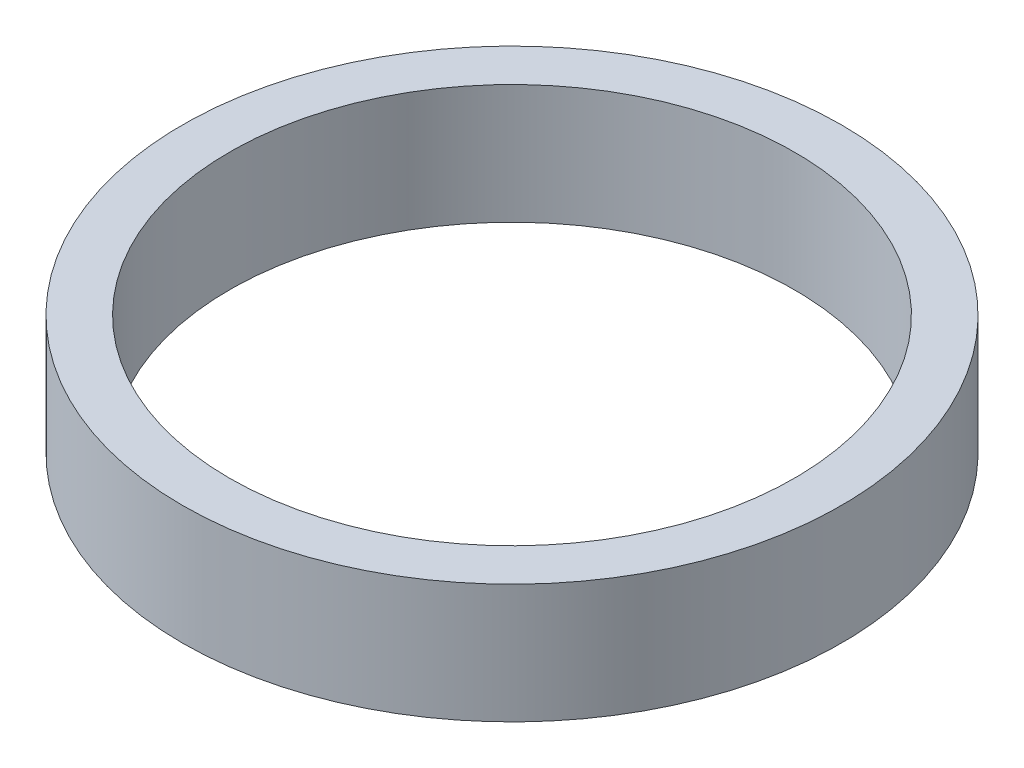
ISO-10303-21;
HEADER;
FILE_DESCRIPTION(('STEP AP214'),'2;1');
FILE_NAME('part.step','',(''),(''),'','','');
FILE_SCHEMA(('AUTOMOTIVE_DESIGN { 1 0 10303 214 1 1 1 1 }'));
ENDSEC;
DATA;
#1=APPLICATION_CONTEXT('core data for automotive mechanical design processes');
#2=APPLICATION_PROTOCOL_DEFINITION('international standard','automotive_design',2000,#1);
#3=PRODUCT_CONTEXT('',#1,'mechanical');
#4=PRODUCT('Part','Part','',(#3));
#5=PRODUCT_RELATED_PRODUCT_CATEGORY('part','',(#4));
#6=PRODUCT_DEFINITION_FORMATION('','',#4);
#7=PRODUCT_DEFINITION_CONTEXT('part definition',#1,'design');
#8=PRODUCT_DEFINITION('design','',#6,#7);
#9=PRODUCT_DEFINITION_SHAPE('','',#8);
#10=(LENGTH_UNIT() NAMED_UNIT(*) SI_UNIT(.MILLI.,.METRE.));
#11=(NAMED_UNIT(*) PLANE_ANGLE_UNIT() SI_UNIT($,.RADIAN.));
#12=(NAMED_UNIT(*) SI_UNIT($,.STERADIAN.) SOLID_ANGLE_UNIT());
#13=UNCERTAINTY_MEASURE_WITH_UNIT(LENGTH_MEASURE(1.E-05),#10,'distance_accuracy_value','');
#14=(GEOMETRIC_REPRESENTATION_CONTEXT(3) GLOBAL_UNCERTAINTY_ASSIGNED_CONTEXT((#13)) GLOBAL_UNIT_ASSIGNED_CONTEXT((#10,
#11,#12)) REPRESENTATION_CONTEXT('',''));
#15=CARTESIAN_POINT('',(0.,0.,0.));
#16=DIRECTION('',(0.,0.,1.));
#17=DIRECTION('',(1.,0.,0.));
#18=AXIS2_PLACEMENT_3D('',#15,#16,#17);
#19=CARTESIAN_POINT('',(0.,19.,0.));
#20=DIRECTION('',(0.,-1.,0.));
#21=DIRECTION('',(0.,0.,-1.));
#22=AXIS2_PLACEMENT_3D('',#19,#20,#21);
#23=CYLINDRICAL_SURFACE('',#22,52.5);
#24=CARTESIAN_POINT('',(0.,19.,0.));
#25=DIRECTION('',(0.,1.,0.));
#26=DIRECTION('',(0.,0.,1.));
#27=AXIS2_PLACEMENT_3D('',#24,#25,#26);
#28=CIRCLE('',#27,52.5);
#29=CARTESIAN_POINT('',(0.,19.,52.5));
#30=VERTEX_POINT('',#29);
#31=EDGE_CURVE('E10',#30,#30,#28,.T.);
#32=ORIENTED_EDGE('',*,*,#31,.F.);
#33=EDGE_LOOP('',(#32));
#34=FACE_BOUND('',#33,.T.);
#35=CARTESIAN_POINT('',(0.,0.,0.));
#36=DIRECTION('',(0.,1.,0.));
#37=DIRECTION('',(0.,0.,1.));
#38=AXIS2_PLACEMENT_3D('',#35,#36,#37);
#39=CIRCLE('',#38,52.5);
#40=CARTESIAN_POINT('',(0.,0.,52.5));
#41=VERTEX_POINT('',#40);
#42=EDGE_CURVE('E37',#41,#41,#39,.T.);
#43=ORIENTED_EDGE('',*,*,#42,.T.);
#44=EDGE_LOOP('',(#43));
#45=FACE_BOUND('',#44,.T.);
#46=ADVANCED_FACE('F40',(#34,#45),#23,.T.);
#47=CARTESIAN_POINT('',(0.,19.,0.));
#48=DIRECTION('',(0.,1.,0.));
#49=DIRECTION('',(0.,0.,1.));
#50=AXIS2_PLACEMENT_3D('',#47,#48,#49);
#51=PLANE('',#50);
#52=CARTESIAN_POINT('',(0.,19.,0.));
#53=DIRECTION('',(0.,1.,0.));
#54=DIRECTION('',(0.,0.,1.));
#55=AXIS2_PLACEMENT_3D('',#52,#53,#54);
#56=CIRCLE('',#55,45.);
#57=CARTESIAN_POINT('',(0.,19.,45.));
#58=VERTEX_POINT('',#57);
#59=EDGE_CURVE('E50',#58,#58,#56,.T.);
#60=ORIENTED_EDGE('',*,*,#59,.F.);
#61=EDGE_LOOP('',(#60));
#62=FACE_BOUND('',#61,.T.);
#63=ORIENTED_EDGE('',*,*,#31,.T.);
#64=EDGE_LOOP('',(#63));
#65=FACE_BOUND('',#64,.T.);
#66=ADVANCED_FACE('F59',(#62,#65),#51,.T.);
#67=CARTESIAN_POINT('',(0.,0.,0.));
#68=DIRECTION('',(0.,1.,0.));
#69=DIRECTION('',(0.,0.,1.));
#70=AXIS2_PLACEMENT_3D('',#67,#68,#69);
#71=PLANE('',#70);
#72=CARTESIAN_POINT('',(0.,0.,0.));
#73=DIRECTION('',(0.,1.,0.));
#74=DIRECTION('',(0.,0.,1.));
#75=AXIS2_PLACEMENT_3D('',#72,#73,#74);
#76=CIRCLE('',#75,45.);
#77=CARTESIAN_POINT('',(0.,0.,45.));
#78=VERTEX_POINT('',#77);
#79=EDGE_CURVE('E47',#78,#78,#76,.T.);
#80=ORIENTED_EDGE('',*,*,#79,.T.);
#81=EDGE_LOOP('',(#80));
#82=FACE_BOUND('',#81,.T.);
#83=ORIENTED_EDGE('',*,*,#42,.F.);
#84=EDGE_LOOP('',(#83));
#85=FACE_BOUND('',#84,.T.);
#86=ADVANCED_FACE('F58',(#82,#85),#71,.F.);
#87=CARTESIAN_POINT('',(0.,19.,0.));
#88=DIRECTION('',(0.,-1.,0.));
#89=DIRECTION('',(0.,0.,-1.));
#90=AXIS2_PLACEMENT_3D('',#87,#88,#89);
#91=CYLINDRICAL_SURFACE('',#90,45.);
#92=ORIENTED_EDGE('',*,*,#59,.T.);
#93=EDGE_LOOP('',(#92));
#94=FACE_BOUND('',#93,.T.);
#95=ORIENTED_EDGE('',*,*,#79,.F.);
#96=EDGE_LOOP('',(#95));
#97=FACE_BOUND('',#96,.T.);
#98=ADVANCED_FACE('F54',(#94,#97),#91,.F.);
#99=CLOSED_SHELL('',(#46,#66,#86,#98));
#100=MANIFOLD_SOLID_BREP('B2',#99);
#101=ADVANCED_BREP_SHAPE_REPRESENTATION('',(#18,#100),#14);
#102=SHAPE_DEFINITION_REPRESENTATION(#9,#101);
ENDSEC;
END-ISO-10303-21;
